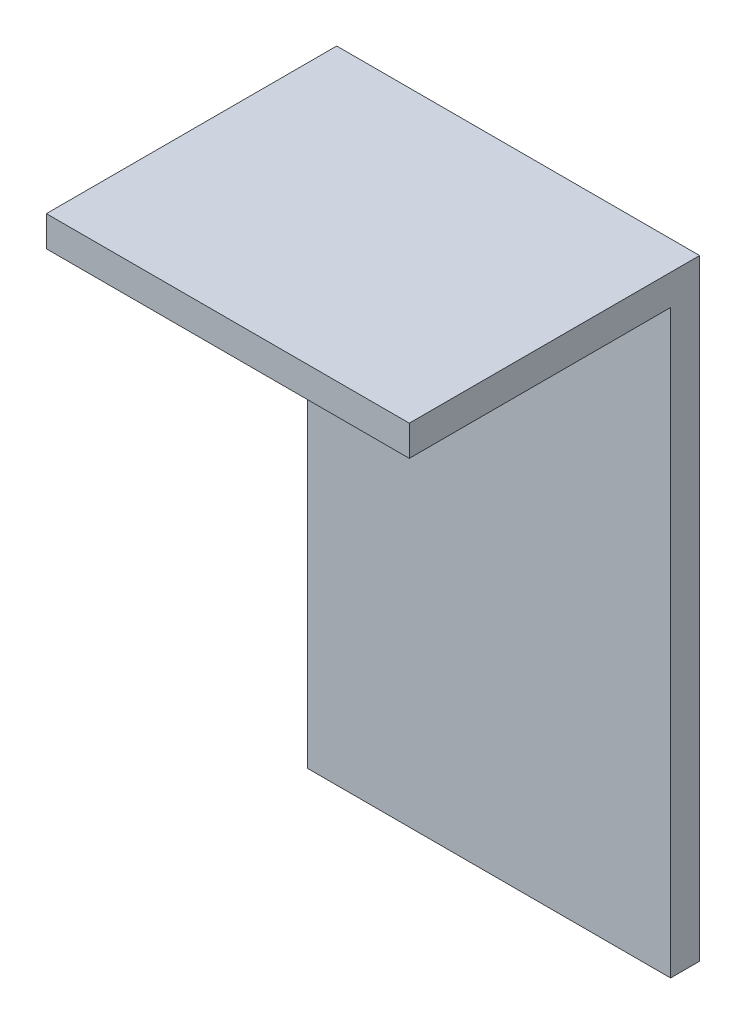
ISO-10303-21;
HEADER;
FILE_DESCRIPTION(('STEP AP214'),'2;1');
FILE_NAME('part.step','',(''),(''),'','','');
FILE_SCHEMA(('AUTOMOTIVE_DESIGN { 1 0 10303 214 1 1 1 1 }'));
ENDSEC;
DATA;
#1=APPLICATION_CONTEXT('core data for automotive mechanical design processes');
#2=APPLICATION_PROTOCOL_DEFINITION('international standard','automotive_design',2000,#1);
#3=PRODUCT_CONTEXT('',#1,'mechanical');
#4=PRODUCT('Part','Part','',(#3));
#5=PRODUCT_RELATED_PRODUCT_CATEGORY('part','',(#4));
#6=PRODUCT_DEFINITION_FORMATION('','',#4);
#7=PRODUCT_DEFINITION_CONTEXT('part definition',#1,'design');
#8=PRODUCT_DEFINITION('design','',#6,#7);
#9=PRODUCT_DEFINITION_SHAPE('','',#8);
#10=(LENGTH_UNIT() NAMED_UNIT(*) SI_UNIT(.MILLI.,.METRE.));
#11=(NAMED_UNIT(*) PLANE_ANGLE_UNIT() SI_UNIT($,.RADIAN.));
#12=(NAMED_UNIT(*) SI_UNIT($,.STERADIAN.) SOLID_ANGLE_UNIT());
#13=UNCERTAINTY_MEASURE_WITH_UNIT(LENGTH_MEASURE(1.E-05),#10,'distance_accuracy_value','');
#14=(GEOMETRIC_REPRESENTATION_CONTEXT(3) GLOBAL_UNCERTAINTY_ASSIGNED_CONTEXT((#13)) GLOBAL_UNIT_ASSIGNED_CONTEXT((#10,
#11,#12)) REPRESENTATION_CONTEXT('',''));
#15=CARTESIAN_POINT('',(0.,0.,0.));
#16=DIRECTION('',(0.,0.,1.));
#17=DIRECTION('',(1.,0.,0.));
#18=AXIS2_PLACEMENT_3D('',#15,#16,#17);
#19=CARTESIAN_POINT('',(0.221679300404559,1.5105,0.2));
#20=DIRECTION('',(0.,0.,1.));
#21=DIRECTION('',(0.,-1.,0.));
#22=AXIS2_PLACEMENT_3D('',#19,#20,#21);
#23=PLANE('',#22);
#24=DIRECTION('',(0.,-1.,0.));
#25=VECTOR('',#24,1.);
#26=CARTESIAN_POINT('',(0.346679300404559,1.36847101449275,0.2));
#27=LINE('',#26,#25);
#28=CARTESIAN_POINT('',(0.346679300404559,1.521,0.2));
#29=VERTEX_POINT('',#28);
#30=CARTESIAN_POINT('',(0.346679300404559,1.5,0.2));
#31=VERTEX_POINT('',#30);
#32=EDGE_CURVE('E92',#29,#31,#27,.T.);
#33=ORIENTED_EDGE('',*,*,#32,.F.);
#34=DIRECTION('',(1.,0.,0.));
#35=VECTOR('',#34,1.);
#36=CARTESIAN_POINT('',(0.221679300404559,1.521,0.2));
#37=LINE('',#36,#35);
#38=CARTESIAN_POINT('',(0.0966793004045591,1.521,0.2));
#39=VERTEX_POINT('',#38);
#40=EDGE_CURVE('E86',#39,#29,#37,.T.);
#41=ORIENTED_EDGE('',*,*,#40,.F.);
#42=DIRECTION('',(0.,-1.,0.));
#43=VECTOR('',#42,1.);
#44=CARTESIAN_POINT('',(0.0966793004045598,1.36847101449275,0.2));
#45=LINE('',#44,#43);
#46=CARTESIAN_POINT('',(0.0966793004045592,1.5,0.2));
#47=VERTEX_POINT('',#46);
#48=EDGE_CURVE('E89',#39,#47,#45,.T.);
#49=ORIENTED_EDGE('',*,*,#48,.T.);
#50=DIRECTION('',(1.,0.,0.));
#51=VECTOR('',#50,1.);
#52=CARTESIAN_POINT('',(0.221679300404559,1.5,0.2));
#53=LINE('',#52,#51);
#54=EDGE_CURVE('E11',#47,#31,#53,.T.);
#55=ORIENTED_EDGE('',*,*,#54,.T.);
#56=EDGE_LOOP('',(#33,#41,#49,#55));
#57=FACE_BOUND('',#56,.T.);
#58=ADVANCED_FACE('F17',(#57),#23,.T.);
#59=CARTESIAN_POINT('',(0.221679300404559,1.5,0.11));
#60=DIRECTION('',(0.,1.,0.));
#61=DIRECTION('',(1.,0.,0.));
#62=AXIS2_PLACEMENT_3D('',#59,#60,#61);
#63=PLANE('',#62);
#64=DIRECTION('',(0.,0.,-1.));
#65=VECTOR('',#64,1.);
#66=CARTESIAN_POINT('',(0.0966793004045593,1.5,0.0420289855072467));
#67=LINE('',#66,#65);
#68=CARTESIAN_POINT('',(0.0966793004045592,1.5,0.02));
#69=VERTEX_POINT('',#68);
#70=EDGE_CURVE('E111',#47,#69,#67,.T.);
#71=ORIENTED_EDGE('',*,*,#70,.T.);
#72=DIRECTION('',(-1.,0.,0.));
#73=VECTOR('',#72,1.);
#74=CARTESIAN_POINT('',(0.22167930040456,1.5,0.02));
#75=LINE('',#74,#73);
#76=CARTESIAN_POINT('',(0.346679300404559,1.5,0.02));
#77=VERTEX_POINT('',#76);
#78=EDGE_CURVE('E21',#77,#69,#75,.T.);
#79=ORIENTED_EDGE('',*,*,#78,.F.);
#80=DIRECTION('',(0.,0.,-1.));
#81=VECTOR('',#80,1.);
#82=CARTESIAN_POINT('',(0.346679300404559,1.5,0.0420289855072467));
#83=LINE('',#82,#81);
#84=EDGE_CURVE('E123',#31,#77,#83,.T.);
#85=ORIENTED_EDGE('',*,*,#84,.F.);
#86=ORIENTED_EDGE('',*,*,#54,.F.);
#87=EDGE_LOOP('',(#71,#79,#85,#86));
#88=FACE_BOUND('',#87,.T.);
#89=ADVANCED_FACE('F287',(#88),#63,.F.);
#90=CARTESIAN_POINT('',(0.22167930040456,1.3,0.02));
#91=DIRECTION('',(0.,0.,1.));
#92=DIRECTION('',(0.,-1.,0.));
#93=AXIS2_PLACEMENT_3D('',#90,#91,#92);
#94=PLANE('',#93);
#95=DIRECTION('',(0.,-1.,0.));
#96=VECTOR('',#95,1.);
#97=CARTESIAN_POINT('',(0.0966793004045598,1.36847101449275,0.02));
#98=LINE('',#97,#96);
#99=CARTESIAN_POINT('',(0.0966793004045604,1.1,0.02));
#100=VERTEX_POINT('',#99);
#101=EDGE_CURVE('E118',#69,#100,#98,.T.);
#102=ORIENTED_EDGE('',*,*,#101,.T.);
#103=DIRECTION('',(1.,0.,0.));
#104=VECTOR('',#103,1.);
#105=CARTESIAN_POINT('',(0.221679300404561,1.1,0.02));
#106=LINE('',#105,#104);
#107=CARTESIAN_POINT('',(0.346679300404561,1.1,0.02));
#108=VERTEX_POINT('',#107);
#109=EDGE_CURVE('E149',#100,#108,#106,.T.);
#110=ORIENTED_EDGE('',*,*,#109,.T.);
#111=DIRECTION('',(0.,-1.,0.));
#112=VECTOR('',#111,1.);
#113=CARTESIAN_POINT('',(0.346679300404559,1.36847101449275,0.02));
#114=LINE('',#113,#112);
#115=EDGE_CURVE('E121',#77,#108,#114,.T.);
#116=ORIENTED_EDGE('',*,*,#115,.F.);
#117=ORIENTED_EDGE('',*,*,#78,.T.);
#118=EDGE_LOOP('',(#102,#110,#116,#117));
#119=FACE_BOUND('',#118,.T.);
#120=ADVANCED_FACE('F19',(#119),#94,.T.);
#121=CARTESIAN_POINT('',(0.346679300404559,1.36847101449275,0.0420289855072467));
#122=DIRECTION('',(1.,0.,0.));
#123=DIRECTION('',(0.,1.,0.));
#124=AXIS2_PLACEMENT_3D('',#121,#122,#123);
#125=PLANE('',#124);
#126=DIRECTION('',(0.,0.,-1.));
#127=VECTOR('',#126,1.);
#128=CARTESIAN_POINT('',(0.346679300404559,1.521,0.1));
#129=LINE('',#128,#127);
#130=CARTESIAN_POINT('',(0.346679300404559,1.521,0.));
#131=VERTEX_POINT('',#130);
#132=EDGE_CURVE('E96',#29,#131,#129,.T.);
#133=ORIENTED_EDGE('',*,*,#132,.F.);
#134=ORIENTED_EDGE('',*,*,#32,.T.);
#135=ORIENTED_EDGE('',*,*,#84,.T.);
#136=ORIENTED_EDGE('',*,*,#115,.T.);
#137=DIRECTION('',(0.,0.,-1.));
#138=VECTOR('',#137,1.);
#139=CARTESIAN_POINT('',(0.346679300404561,1.1,0.01));
#140=LINE('',#139,#138);
#141=CARTESIAN_POINT('',(0.346679300404561,1.1,0.));
#142=VERTEX_POINT('',#141);
#143=EDGE_CURVE('E144',#108,#142,#140,.T.);
#144=ORIENTED_EDGE('',*,*,#143,.T.);
#145=DIRECTION('',(0.,1.,0.));
#146=VECTOR('',#145,1.);
#147=CARTESIAN_POINT('',(0.346679300404561,1.3105,0.));
#148=LINE('',#147,#146);
#149=EDGE_CURVE('E138',#142,#131,#148,.T.);
#150=ORIENTED_EDGE('',*,*,#149,.T.);
#151=EDGE_LOOP('',(#133,#134,#135,#136,#144,#150));
#152=FACE_BOUND('',#151,.T.);
#153=ADVANCED_FACE('F264',(#152),#125,.T.);
#154=CARTESIAN_POINT('',(0.221679300404559,1.521,0.1));
#155=DIRECTION('',(0.,1.,0.));
#156=DIRECTION('',(1.,0.,0.));
#157=AXIS2_PLACEMENT_3D('',#154,#155,#156);
#158=PLANE('',#157);
#159=ORIENTED_EDGE('',*,*,#40,.T.);
#160=ORIENTED_EDGE('',*,*,#132,.T.);
#161=DIRECTION('',(-1.,0.,0.));
#162=VECTOR('',#161,1.);
#163=CARTESIAN_POINT('',(0.22167930040456,1.521,0.));
#164=LINE('',#163,#162);
#165=CARTESIAN_POINT('',(0.0966793004045591,1.521,0.));
#166=VERTEX_POINT('',#165);
#167=EDGE_CURVE('E103',#131,#166,#164,.T.);
#168=ORIENTED_EDGE('',*,*,#167,.T.);
#169=DIRECTION('',(0.,0.,1.));
#170=VECTOR('',#169,1.);
#171=CARTESIAN_POINT('',(0.0966793004045592,1.521,0.0420289855072467));
#172=LINE('',#171,#170);
#173=EDGE_CURVE('E97',#166,#39,#172,.T.);
#174=ORIENTED_EDGE('',*,*,#173,.T.);
#175=EDGE_LOOP('',(#159,#160,#168,#174));
#176=FACE_BOUND('',#175,.T.);
#177=ADVANCED_FACE('F101',(#176),#158,.T.);
#178=CARTESIAN_POINT('',(0.0966793004045598,1.36847101449275,0.0420289855072467));
#179=DIRECTION('',(1.,0.,0.));
#180=DIRECTION('',(0.,1.,0.));
#181=AXIS2_PLACEMENT_3D('',#178,#179,#180);
#182=PLANE('',#181);
#183=ORIENTED_EDGE('',*,*,#101,.F.);
#184=ORIENTED_EDGE('',*,*,#70,.F.);
#185=ORIENTED_EDGE('',*,*,#48,.F.);
#186=ORIENTED_EDGE('',*,*,#173,.F.);
#187=DIRECTION('',(0.,-1.,0.));
#188=VECTOR('',#187,1.);
#189=CARTESIAN_POINT('',(0.0966793004045591,1.3105,0.));
#190=LINE('',#189,#188);
#191=CARTESIAN_POINT('',(0.0966793004045604,1.1,0.));
#192=VERTEX_POINT('',#191);
#193=EDGE_CURVE('E159',#166,#192,#190,.T.);
#194=ORIENTED_EDGE('',*,*,#193,.T.);
#195=DIRECTION('',(0.,0.,1.));
#196=VECTOR('',#195,1.);
#197=CARTESIAN_POINT('',(0.0966793004045605,1.1,0.01));
#198=LINE('',#197,#196);
#199=EDGE_CURVE('E145',#192,#100,#198,.T.);
#200=ORIENTED_EDGE('',*,*,#199,.T.);
#201=EDGE_LOOP('',(#183,#184,#185,#186,#194,#200));
#202=FACE_BOUND('',#201,.T.);
#203=ADVANCED_FACE('F110',(#202),#182,.F.);
#204=CARTESIAN_POINT('',(0.221679300404561,1.1,0.01));
#205=DIRECTION('',(0.,1.,0.));
#206=DIRECTION('',(0.,0.,-1.));
#207=AXIS2_PLACEMENT_3D('',#204,#205,#206);
#208=PLANE('',#207);
#209=ORIENTED_EDGE('',*,*,#143,.F.);
#210=ORIENTED_EDGE('',*,*,#109,.F.);
#211=ORIENTED_EDGE('',*,*,#199,.F.);
#212=DIRECTION('',(1.,0.,0.));
#213=VECTOR('',#212,1.);
#214=CARTESIAN_POINT('',(0.22167930040456,1.1,0.));
#215=LINE('',#214,#213);
#216=EDGE_CURVE('E140',#192,#142,#215,.T.);
#217=ORIENTED_EDGE('',*,*,#216,.T.);
#218=EDGE_LOOP('',(#209,#210,#211,#217));
#219=FACE_BOUND('',#218,.T.);
#220=ADVANCED_FACE('F162',(#219),#208,.F.);
#221=CARTESIAN_POINT('',(0.22167930040456,1.3105,0.));
#222=DIRECTION('',(0.,0.,1.));
#223=DIRECTION('',(0.,-1.,0.));
#224=AXIS2_PLACEMENT_3D('',#221,#222,#223);
#225=PLANE('',#224);
#226=ORIENTED_EDGE('',*,*,#193,.F.);
#227=ORIENTED_EDGE('',*,*,#167,.F.);
#228=ORIENTED_EDGE('',*,*,#149,.F.);
#229=ORIENTED_EDGE('',*,*,#216,.F.);
#230=EDGE_LOOP('',(#226,#227,#228,#229));
#231=FACE_BOUND('',#230,.T.);
#232=ADVANCED_FACE('F274',(#231),#225,.F.);
#233=CLOSED_SHELL('',(#58,#89,#120,#153,#177,#203,#220,#232));
#234=MANIFOLD_SOLID_BREP('B1',#233);
#235=ADVANCED_BREP_SHAPE_REPRESENTATION('',(#18,#234),#14);
#236=SHAPE_DEFINITION_REPRESENTATION(#9,#235);
ENDSEC;
END-ISO-10303-21;
